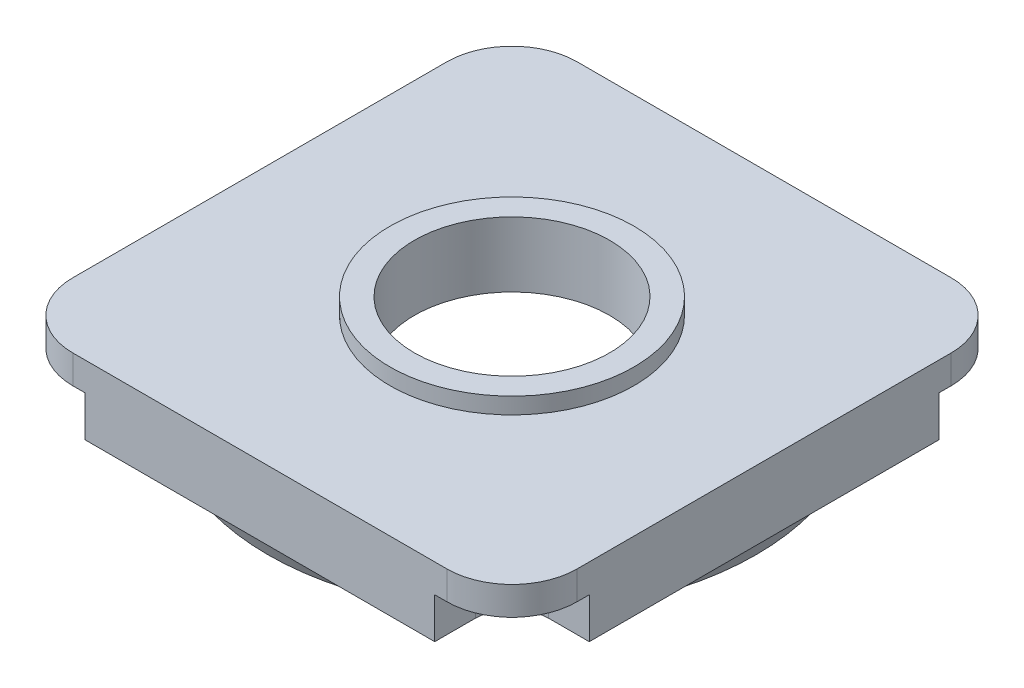
ISO-10303-21;
HEADER;
FILE_DESCRIPTION(('STEP AP214'),'2;1');
FILE_NAME('part.step','',(''),(''),'','','');
FILE_SCHEMA(('AUTOMOTIVE_DESIGN { 1 0 10303 214 1 1 1 1 }'));
ENDSEC;
DATA;
#1=APPLICATION_CONTEXT('core data for automotive mechanical design processes');
#2=APPLICATION_PROTOCOL_DEFINITION('international standard','automotive_design',2000,#1);
#3=PRODUCT_CONTEXT('',#1,'mechanical');
#4=PRODUCT('Part','Part','',(#3));
#5=PRODUCT_RELATED_PRODUCT_CATEGORY('part','',(#4));
#6=PRODUCT_DEFINITION_FORMATION('','',#4);
#7=PRODUCT_DEFINITION_CONTEXT('part definition',#1,'design');
#8=PRODUCT_DEFINITION('design','',#6,#7);
#9=PRODUCT_DEFINITION_SHAPE('','',#8);
#10=(LENGTH_UNIT() NAMED_UNIT(*) SI_UNIT(.MILLI.,.METRE.));
#11=(NAMED_UNIT(*) PLANE_ANGLE_UNIT() SI_UNIT($,.RADIAN.));
#12=(NAMED_UNIT(*) SI_UNIT($,.STERADIAN.) SOLID_ANGLE_UNIT());
#13=UNCERTAINTY_MEASURE_WITH_UNIT(LENGTH_MEASURE(1.E-05),#10,'distance_accuracy_value','');
#14=(GEOMETRIC_REPRESENTATION_CONTEXT(3) GLOBAL_UNCERTAINTY_ASSIGNED_CONTEXT((#13)) GLOBAL_UNIT_ASSIGNED_CONTEXT((#10,
#11,#12)) REPRESENTATION_CONTEXT('',''));
#15=CARTESIAN_POINT('',(0.,0.,0.));
#16=DIRECTION('',(0.,0.,1.));
#17=DIRECTION('',(1.,0.,0.));
#18=AXIS2_PLACEMENT_3D('',#15,#16,#17);
#19=CARTESIAN_POINT('',(0.,12.62465,0.));
#20=DIRECTION('',(0.,-1.,0.));
#21=DIRECTION('',(0.,0.,-1.));
#22=AXIS2_PLACEMENT_3D('',#19,#20,#21);
#23=CYLINDRICAL_SURFACE('',#22,27.);
#24=CARTESIAN_POINT('',(0.,-6.,0.));
#25=DIRECTION('',(0.,-1.,0.));
#26=DIRECTION('',(0.,0.,-1.));
#27=AXIS2_PLACEMENT_3D('',#24,#25,#26);
#28=CIRCLE('',#27,27.);
#29=CARTESIAN_POINT('',(0.,-6.,-27.));
#30=VERTEX_POINT('',#29);
#31=EDGE_CURVE('E192',#30,#30,#28,.F.);
#32=ORIENTED_EDGE('',*,*,#31,.T.);
#33=EDGE_LOOP('',(#32));
#34=FACE_BOUND('',#33,.T.);
#35=CARTESIAN_POINT('',(0.,-11.,0.));
#36=DIRECTION('',(0.,-1.,0.));
#37=DIRECTION('',(0.,0.,-1.));
#38=AXIS2_PLACEMENT_3D('',#35,#36,#37);
#39=CIRCLE('',#38,27.);
#40=CARTESIAN_POINT('',(0.,-11.,-27.));
#41=VERTEX_POINT('',#40);
#42=EDGE_CURVE('E906',#41,#41,#39,.T.);
#43=ORIENTED_EDGE('',*,*,#42,.T.);
#44=EDGE_LOOP('',(#43));
#45=FACE_BOUND('',#44,.T.);
#46=ADVANCED_FACE('F16',(#34,#45),#23,.F.);
#47=CARTESIAN_POINT('',(0.,-10.5,0.));
#48=DIRECTION('',(0.,-1.,0.));
#49=DIRECTION('',(0.,0.,-1.));
#50=AXIS2_PLACEMENT_3D('',#47,#48,#49);
#51=PLANE('',#50);
#52=CARTESIAN_POINT('',(0.,-10.5,0.));
#53=DIRECTION('',(0.,-1.,0.));
#54=DIRECTION('',(0.,0.,-1.));
#55=AXIS2_PLACEMENT_3D('',#52,#53,#54);
#56=CIRCLE('',#55,28.3645835281067);
#57=CARTESIAN_POINT('',(0.,-10.5,-28.3645835281067));
#58=VERTEX_POINT('',#57);
#59=EDGE_CURVE('E11',#58,#58,#56,.T.);
#60=ORIENTED_EDGE('',*,*,#59,.F.);
#61=EDGE_LOOP('',(#60));
#62=FACE_BOUND('',#61,.T.);
#63=CARTESIAN_POINT('',(0.,-10.5,0.));
#64=DIRECTION('',(0.,1.,0.));
#65=DIRECTION('',(0.,0.,1.));
#66=AXIS2_PLACEMENT_3D('',#63,#64,#65);
#67=CIRCLE('',#66,30.);
#68=CARTESIAN_POINT('',(0.,-10.5,30.));
#69=VERTEX_POINT('',#68);
#70=EDGE_CURVE('E173',#69,#69,#67,.T.);
#71=ORIENTED_EDGE('',*,*,#70,.F.);
#72=EDGE_LOOP('',(#71));
#73=FACE_BOUND('',#72,.T.);
#74=ADVANCED_FACE('F528',(#62,#73),#51,.T.);
#75=CARTESIAN_POINT('',(0.,-8.5,0.));
#76=DIRECTION('',(0.,1.,0.));
#77=DIRECTION('',(0.,0.,1.));
#78=AXIS2_PLACEMENT_3D('',#75,#76,#77);
#79=CONICAL_SURFACE('',#78,31.,0.463647609000754);
#80=ORIENTED_EDGE('',*,*,#70,.T.);
#81=EDGE_LOOP('',(#80));
#82=FACE_BOUND('',#81,.T.);
#83=CARTESIAN_POINT('',(0.,-8.5,0.));
#84=DIRECTION('',(0.,1.,0.));
#85=DIRECTION('',(0.,0.,1.));
#86=AXIS2_PLACEMENT_3D('',#83,#84,#85);
#87=CIRCLE('',#86,31.);
#88=CARTESIAN_POINT('',(6.43051965842911E-08,-8.5,31.));
#89=VERTEX_POINT('',#88);
#90=CARTESIAN_POINT('',(-31.,-8.5,5.64992497231742E-10));
#91=VERTEX_POINT('',#90);
#92=EDGE_CURVE('E260',#89,#91,#87,.F.);
#93=ORIENTED_EDGE('',*,*,#92,.T.);
#94=CARTESIAN_POINT('',(0.,-8.5,0.));
#95=DIRECTION('',(0.,1.,0.));
#96=DIRECTION('',(0.,0.,1.));
#97=AXIS2_PLACEMENT_3D('',#94,#95,#96);
#98=CIRCLE('',#97,31.);
#99=CARTESIAN_POINT('',(-6.43051948495677E-08,-8.5,-31.));
#100=VERTEX_POINT('',#99);
#101=EDGE_CURVE('E268',#91,#100,#98,.F.);
#102=ORIENTED_EDGE('',*,*,#101,.T.);
#103=CARTESIAN_POINT('',(0.,-8.5,0.));
#104=DIRECTION('',(0.,1.,0.));
#105=DIRECTION('',(0.,0.,1.));
#106=AXIS2_PLACEMENT_3D('',#103,#104,#105);
#107=CIRCLE('',#106,31.);
#108=CARTESIAN_POINT('',(31.,-8.5,1.02969922519125E-07));
#109=VERTEX_POINT('',#108);
#110=EDGE_CURVE('E178',#100,#109,#107,.F.);
#111=ORIENTED_EDGE('',*,*,#110,.T.);
#112=CARTESIAN_POINT('',(0.,-8.5,0.));
#113=DIRECTION('',(0.,1.,0.));
#114=DIRECTION('',(0.,0.,1.));
#115=AXIS2_PLACEMENT_3D('',#112,#113,#114);
#116=CIRCLE('',#115,31.);
#117=EDGE_CURVE('E276',#109,#89,#116,.F.);
#118=ORIENTED_EDGE('',*,*,#117,.T.);
#119=EDGE_LOOP('',(#93,#102,#111,#118));
#120=FACE_BOUND('',#119,.T.);
#121=ADVANCED_FACE('F358',(#82,#120),#79,.T.);
#122=CARTESIAN_POINT('',(26.,3.8325,-26.));
#123=DIRECTION('',(0.,-1.,0.));
#124=DIRECTION('',(0.,0.,-1.));
#125=AXIS2_PLACEMENT_3D('',#122,#123,#124);
#126=CYLINDRICAL_SURFACE('',#125,4.5);
#127=DIRECTION('',(0.,1.,0.));
#128=VECTOR('',#127,1.);
#129=CARTESIAN_POINT('',(21.5,-3.5,-26.));
#130=LINE('',#129,#128);
#131=CARTESIAN_POINT('',(21.5,-8.5,-26.));
#132=VERTEX_POINT('',#131);
#133=CARTESIAN_POINT('',(21.5,-3.5,-26.));
#134=VERTEX_POINT('',#133);
#135=EDGE_CURVE('E162',#132,#134,#130,.T.);
#136=ORIENTED_EDGE('',*,*,#135,.T.);
#137=CARTESIAN_POINT('',(26.,-3.5,-26.));
#138=DIRECTION('',(0.,-1.,0.));
#139=DIRECTION('',(0.,0.,-1.));
#140=AXIS2_PLACEMENT_3D('',#137,#138,#139);
#141=CIRCLE('',#140,4.5);
#142=CARTESIAN_POINT('',(26.,-3.5,-21.5));
#143=VERTEX_POINT('',#142);
#144=EDGE_CURVE('E257',#143,#134,#141,.T.);
#145=ORIENTED_EDGE('',*,*,#144,.F.);
#146=DIRECTION('',(0.,1.,0.));
#147=VECTOR('',#146,1.);
#148=CARTESIAN_POINT('',(26.,-3.5,-21.5));
#149=LINE('',#148,#147);
#150=CARTESIAN_POINT('',(26.,-8.5,-21.5));
#151=VERTEX_POINT('',#150);
#152=EDGE_CURVE('E182',#143,#151,#149,.F.);
#153=ORIENTED_EDGE('',*,*,#152,.T.);
#154=CARTESIAN_POINT('',(26.,-8.5,-26.));
#155=DIRECTION('',(0.,-1.,0.));
#156=DIRECTION('',(0.,0.,-1.));
#157=AXIS2_PLACEMENT_3D('',#154,#155,#156);
#158=CIRCLE('',#157,4.5);
#159=EDGE_CURVE('E156',#151,#132,#158,.T.);
#160=ORIENTED_EDGE('',*,*,#159,.T.);
#161=EDGE_LOOP('',(#136,#145,#153,#160));
#162=FACE_BOUND('',#161,.T.);
#163=ADVANCED_FACE('F181',(#162),#126,.F.);
#164=CARTESIAN_POINT('',(26.,3.8375,26.));
#165=DIRECTION('',(0.,-1.,0.));
#166=DIRECTION('',(0.,0.,-1.));
#167=AXIS2_PLACEMENT_3D('',#164,#165,#166);
#168=CYLINDRICAL_SURFACE('',#167,4.5);
#169=DIRECTION('',(0.,1.,0.));
#170=VECTOR('',#169,1.);
#171=CARTESIAN_POINT('',(26.,-3.5,21.5));
#172=LINE('',#171,#170);
#173=CARTESIAN_POINT('',(26.,-8.5,21.5));
#174=VERTEX_POINT('',#173);
#175=CARTESIAN_POINT('',(26.,-3.5,21.5));
#176=VERTEX_POINT('',#175);
#177=EDGE_CURVE('E183',#174,#176,#172,.T.);
#178=ORIENTED_EDGE('',*,*,#177,.T.);
#179=CARTESIAN_POINT('',(26.,-3.5,26.));
#180=DIRECTION('',(0.,-1.,0.));
#181=DIRECTION('',(0.,0.,-1.));
#182=AXIS2_PLACEMENT_3D('',#179,#180,#181);
#183=CIRCLE('',#182,4.5);
#184=CARTESIAN_POINT('',(21.5,-3.5,26.));
#185=VERTEX_POINT('',#184);
#186=EDGE_CURVE('E253',#185,#176,#183,.T.);
#187=ORIENTED_EDGE('',*,*,#186,.F.);
#188=DIRECTION('',(0.,1.,0.));
#189=VECTOR('',#188,1.);
#190=CARTESIAN_POINT('',(21.5,-3.5,26.));
#191=LINE('',#190,#189);
#192=CARTESIAN_POINT('',(21.5,-8.5,26.));
#193=VERTEX_POINT('',#192);
#194=EDGE_CURVE('E302',#185,#193,#191,.F.);
#195=ORIENTED_EDGE('',*,*,#194,.T.);
#196=CARTESIAN_POINT('',(26.,-8.5,26.));
#197=DIRECTION('',(0.,-1.,0.));
#198=DIRECTION('',(0.,0.,-1.));
#199=AXIS2_PLACEMENT_3D('',#196,#197,#198);
#200=CIRCLE('',#199,4.5);
#201=EDGE_CURVE('E280',#193,#174,#200,.T.);
#202=ORIENTED_EDGE('',*,*,#201,.T.);
#203=EDGE_LOOP('',(#178,#187,#195,#202));
#204=FACE_BOUND('',#203,.T.);
#205=ADVANCED_FACE('F719',(#204),#168,.F.);
#206=CARTESIAN_POINT('',(-26.,3.8375,-26.));
#207=DIRECTION('',(0.,-1.,0.));
#208=DIRECTION('',(0.,0.,-1.));
#209=AXIS2_PLACEMENT_3D('',#206,#207,#208);
#210=CYLINDRICAL_SURFACE('',#209,4.5);
#211=DIRECTION('',(0.,1.,0.));
#212=VECTOR('',#211,1.);
#213=CARTESIAN_POINT('',(-26.,-3.5,-21.5));
#214=LINE('',#213,#212);
#215=CARTESIAN_POINT('',(-26.,-8.5,-21.5));
#216=VERTEX_POINT('',#215);
#217=CARTESIAN_POINT('',(-26.,-3.5,-21.5));
#218=VERTEX_POINT('',#217);
#219=EDGE_CURVE('E299',#216,#218,#214,.T.);
#220=ORIENTED_EDGE('',*,*,#219,.T.);
#221=CARTESIAN_POINT('',(-26.,-3.5,-26.));
#222=DIRECTION('',(0.,-1.,0.));
#223=DIRECTION('',(0.,0.,-1.));
#224=AXIS2_PLACEMENT_3D('',#221,#222,#223);
#225=CIRCLE('',#224,4.5);
#226=CARTESIAN_POINT('',(-21.5,-3.5,-26.));
#227=VERTEX_POINT('',#226);
#228=EDGE_CURVE('E249',#227,#218,#225,.T.);
#229=ORIENTED_EDGE('',*,*,#228,.F.);
#230=DIRECTION('',(0.,1.,0.));
#231=VECTOR('',#230,1.);
#232=CARTESIAN_POINT('',(-21.5,-3.5,-26.));
#233=LINE('',#232,#231);
#234=CARTESIAN_POINT('',(-21.5,-8.5,-26.));
#235=VERTEX_POINT('',#234);
#236=EDGE_CURVE('E172',#227,#235,#233,.F.);
#237=ORIENTED_EDGE('',*,*,#236,.T.);
#238=CARTESIAN_POINT('',(-26.,-8.5,-26.));
#239=DIRECTION('',(0.,-1.,0.));
#240=DIRECTION('',(0.,0.,-1.));
#241=AXIS2_PLACEMENT_3D('',#238,#239,#240);
#242=CIRCLE('',#241,4.5);
#243=EDGE_CURVE('E272',#235,#216,#242,.T.);
#244=ORIENTED_EDGE('',*,*,#243,.T.);
#245=EDGE_LOOP('',(#220,#229,#237,#244));
#246=FACE_BOUND('',#245,.T.);
#247=ADVANCED_FACE('F726',(#246),#210,.F.);
#248=CARTESIAN_POINT('',(-26.,3.8375,26.));
#249=DIRECTION('',(0.,-1.,0.));
#250=DIRECTION('',(0.,0.,-1.));
#251=AXIS2_PLACEMENT_3D('',#248,#249,#250);
#252=CYLINDRICAL_SURFACE('',#251,4.5);
#253=DIRECTION('',(0.,1.,0.));
#254=VECTOR('',#253,1.);
#255=CARTESIAN_POINT('',(-21.5,-3.5,26.));
#256=LINE('',#255,#254);
#257=CARTESIAN_POINT('',(-21.5,-8.5,26.));
#258=VERTEX_POINT('',#257);
#259=CARTESIAN_POINT('',(-21.5,-3.5,26.));
#260=VERTEX_POINT('',#259);
#261=EDGE_CURVE('E282',#258,#260,#256,.T.);
#262=ORIENTED_EDGE('',*,*,#261,.T.);
#263=CARTESIAN_POINT('',(-26.,-3.5,26.));
#264=DIRECTION('',(0.,-1.,0.));
#265=DIRECTION('',(0.,0.,-1.));
#266=AXIS2_PLACEMENT_3D('',#263,#264,#265);
#267=CIRCLE('',#266,4.5);
#268=CARTESIAN_POINT('',(-26.,-3.5,21.5));
#269=VERTEX_POINT('',#268);
#270=EDGE_CURVE('E246',#269,#260,#267,.T.);
#271=ORIENTED_EDGE('',*,*,#270,.F.);
#272=DIRECTION('',(0.,1.,0.));
#273=VECTOR('',#272,1.);
#274=CARTESIAN_POINT('',(-26.,-3.5,21.5));
#275=LINE('',#274,#273);
#276=CARTESIAN_POINT('',(-26.,-8.5,21.5));
#277=VERTEX_POINT('',#276);
#278=EDGE_CURVE('E296',#269,#277,#275,.F.);
#279=ORIENTED_EDGE('',*,*,#278,.T.);
#280=CARTESIAN_POINT('',(-26.,-8.5,26.));
#281=DIRECTION('',(0.,-1.,0.));
#282=DIRECTION('',(0.,0.,-1.));
#283=AXIS2_PLACEMENT_3D('',#280,#281,#282);
#284=CIRCLE('',#283,4.5);
#285=EDGE_CURVE('E265',#277,#258,#284,.T.);
#286=ORIENTED_EDGE('',*,*,#285,.T.);
#287=EDGE_LOOP('',(#262,#271,#279,#286));
#288=FACE_BOUND('',#287,.T.);
#289=ADVANCED_FACE('F733',(#288),#252,.F.);
#290=CARTESIAN_POINT('',(21.5,-3.5,-26.));
#291=DIRECTION('',(-1.,0.,0.));
#292=DIRECTION('',(0.,0.,1.));
#293=AXIS2_PLACEMENT_3D('',#290,#291,#292);
#294=PLANE('',#293);
#295=DIRECTION('',(0.,0.,-1.));
#296=VECTOR('',#295,1.);
#297=CARTESIAN_POINT('',(21.5,-3.5,-26.));
#298=LINE('',#297,#296);
#299=CARTESIAN_POINT('',(21.5,-3.5,-31.));
#300=VERTEX_POINT('',#299);
#301=EDGE_CURVE('E168',#134,#300,#298,.T.);
#302=ORIENTED_EDGE('',*,*,#301,.F.);
#303=ORIENTED_EDGE('',*,*,#135,.F.);
#304=DIRECTION('',(0.,0.,1.));
#305=VECTOR('',#304,1.);
#306=CARTESIAN_POINT('',(21.5,-8.5,0.));
#307=LINE('',#306,#305);
#308=CARTESIAN_POINT('',(21.5,-8.5,-31.));
#309=VERTEX_POINT('',#308);
#310=EDGE_CURVE('E165',#132,#309,#307,.F.);
#311=ORIENTED_EDGE('',*,*,#310,.T.);
#312=DIRECTION('',(0.,1.,0.));
#313=VECTOR('',#312,1.);
#314=CARTESIAN_POINT('',(21.5,0.,-31.));
#315=LINE('',#314,#313);
#316=EDGE_CURVE('E244',#300,#309,#315,.F.);
#317=ORIENTED_EDGE('',*,*,#316,.F.);
#318=EDGE_LOOP('',(#302,#303,#311,#317));
#319=FACE_BOUND('',#318,.T.);
#320=ADVANCED_FACE('F163',(#319),#294,.F.);
#321=CARTESIAN_POINT('',(-21.5,-3.5,-38.66073282095));
#322=DIRECTION('',(1.,0.,0.));
#323=DIRECTION('',(0.,0.,-1.));
#324=AXIS2_PLACEMENT_3D('',#321,#322,#323);
#325=PLANE('',#324);
#326=DIRECTION('',(0.,0.,-1.));
#327=VECTOR('',#326,1.);
#328=CARTESIAN_POINT('',(-21.5,-3.5,-26.));
#329=LINE('',#328,#327);
#330=CARTESIAN_POINT('',(-21.5,-3.5,-31.));
#331=VERTEX_POINT('',#330);
#332=EDGE_CURVE('E252',#331,#227,#329,.F.);
#333=ORIENTED_EDGE('',*,*,#332,.F.);
#334=DIRECTION('',(0.,1.,0.));
#335=VECTOR('',#334,1.);
#336=CARTESIAN_POINT('',(-21.5,0.,-31.));
#337=LINE('',#336,#335);
#338=CARTESIAN_POINT('',(-21.5,-8.5,-31.));
#339=VERTEX_POINT('',#338);
#340=EDGE_CURVE('E347',#339,#331,#337,.T.);
#341=ORIENTED_EDGE('',*,*,#340,.F.);
#342=DIRECTION('',(0.,0.,1.));
#343=VECTOR('',#342,1.);
#344=CARTESIAN_POINT('',(-21.5,-8.5,0.));
#345=LINE('',#344,#343);
#346=EDGE_CURVE('E275',#339,#235,#345,.T.);
#347=ORIENTED_EDGE('',*,*,#346,.T.);
#348=ORIENTED_EDGE('',*,*,#236,.F.);
#349=EDGE_LOOP('',(#333,#341,#347,#348));
#350=FACE_BOUND('',#349,.T.);
#351=ADVANCED_FACE('F747',(#350),#325,.F.);
#352=CARTESIAN_POINT('',(26.,-3.5,21.5));
#353=DIRECTION('',(0.,0.,-1.));
#354=DIRECTION('',(-1.,0.,0.));
#355=AXIS2_PLACEMENT_3D('',#352,#353,#354);
#356=PLANE('',#355);
#357=DIRECTION('',(1.,0.,0.));
#358=VECTOR('',#357,1.);
#359=CARTESIAN_POINT('',(26.,-3.5,21.5));
#360=LINE('',#359,#358);
#361=CARTESIAN_POINT('',(31.,-3.5,21.5));
#362=VERTEX_POINT('',#361);
#363=EDGE_CURVE('E255',#176,#362,#360,.T.);
#364=ORIENTED_EDGE('',*,*,#363,.F.);
#365=ORIENTED_EDGE('',*,*,#177,.F.);
#366=DIRECTION('',(1.,0.,0.));
#367=VECTOR('',#366,1.);
#368=CARTESIAN_POINT('',(0.,-8.5,21.5));
#369=LINE('',#368,#367);
#370=CARTESIAN_POINT('',(31.,-8.5,21.5));
#371=VERTEX_POINT('',#370);
#372=EDGE_CURVE('E279',#174,#371,#369,.T.);
#373=ORIENTED_EDGE('',*,*,#372,.T.);
#374=DIRECTION('',(0.,1.,0.));
#375=VECTOR('',#374,1.);
#376=CARTESIAN_POINT('',(31.,0.,21.5));
#377=LINE('',#376,#375);
#378=EDGE_CURVE('E240',#362,#371,#377,.F.);
#379=ORIENTED_EDGE('',*,*,#378,.F.);
#380=EDGE_LOOP('',(#364,#365,#373,#379));
#381=FACE_BOUND('',#380,.T.);
#382=ADVANCED_FACE('F477',(#381),#356,.F.);
#383=CARTESIAN_POINT('',(0.,-8.5,0.));
#384=DIRECTION('',(0.,1.,0.));
#385=DIRECTION('',(0.,0.,1.));
#386=AXIS2_PLACEMENT_3D('',#383,#384,#385);
#387=PLANE('',#386);
#388=ORIENTED_EDGE('',*,*,#110,.F.);
#389=DIRECTION('',(-1.,0.,0.));
#390=VECTOR('',#389,1.);
#391=CARTESIAN_POINT('',(31.,-8.5,-31.));
#392=LINE('',#391,#390);
#393=EDGE_CURVE('E177',#309,#100,#392,.T.);
#394=ORIENTED_EDGE('',*,*,#393,.F.);
#395=ORIENTED_EDGE('',*,*,#310,.F.);
#396=ORIENTED_EDGE('',*,*,#159,.F.);
#397=DIRECTION('',(1.,0.,0.));
#398=VECTOR('',#397,1.);
#399=CARTESIAN_POINT('',(36.69825239515,-8.5,-21.5));
#400=LINE('',#399,#398);
#401=CARTESIAN_POINT('',(31.,-8.5,-21.5));
#402=VERTEX_POINT('',#401);
#403=EDGE_CURVE('E292',#151,#402,#400,.T.);
#404=ORIENTED_EDGE('',*,*,#403,.T.);
#405=DIRECTION('',(0.,0.,-1.));
#406=VECTOR('',#405,1.);
#407=CARTESIAN_POINT('',(31.,-8.5,31.));
#408=LINE('',#407,#406);
#409=EDGE_CURVE('E333',#109,#402,#408,.T.);
#410=ORIENTED_EDGE('',*,*,#409,.F.);
#411=EDGE_LOOP('',(#388,#394,#395,#396,#404,#410));
#412=FACE_BOUND('',#411,.T.);
#413=ADVANCED_FACE('F175',(#412),#387,.F.);
#414=CARTESIAN_POINT('',(36.69825239515,-3.5,-21.5));
#415=DIRECTION('',(0.,0.,1.));
#416=DIRECTION('',(1.,0.,0.));
#417=AXIS2_PLACEMENT_3D('',#414,#415,#416);
#418=PLANE('',#417);
#419=DIRECTION('',(1.,0.,0.));
#420=VECTOR('',#419,1.);
#421=CARTESIAN_POINT('',(26.,-3.5,-21.5));
#422=LINE('',#421,#420);
#423=CARTESIAN_POINT('',(31.,-3.5,-21.5));
#424=VERTEX_POINT('',#423);
#425=EDGE_CURVE('E259',#424,#143,#422,.F.);
#426=ORIENTED_EDGE('',*,*,#425,.F.);
#427=DIRECTION('',(0.,1.,0.));
#428=VECTOR('',#427,1.);
#429=CARTESIAN_POINT('',(31.,0.,-21.5));
#430=LINE('',#429,#428);
#431=EDGE_CURVE('E330',#402,#424,#430,.T.);
#432=ORIENTED_EDGE('',*,*,#431,.F.);
#433=ORIENTED_EDGE('',*,*,#403,.F.);
#434=ORIENTED_EDGE('',*,*,#152,.F.);
#435=EDGE_LOOP('',(#426,#432,#433,#434));
#436=FACE_BOUND('',#435,.T.);
#437=ADVANCED_FACE('F484',(#436),#418,.F.);
#438=CARTESIAN_POINT('',(-21.5,-3.5,26.));
#439=DIRECTION('',(1.,0.,0.));
#440=DIRECTION('',(0.,0.,-1.));
#441=AXIS2_PLACEMENT_3D('',#438,#439,#440);
#442=PLANE('',#441);
#443=DIRECTION('',(0.,0.,-1.));
#444=VECTOR('',#443,1.);
#445=CARTESIAN_POINT('',(-21.5,-3.5,-26.));
#446=LINE('',#445,#444);
#447=CARTESIAN_POINT('',(-21.5,-3.5,31.));
#448=VERTEX_POINT('',#447);
#449=EDGE_CURVE('E245',#260,#448,#446,.F.);
#450=ORIENTED_EDGE('',*,*,#449,.F.);
#451=ORIENTED_EDGE('',*,*,#261,.F.);
#452=DIRECTION('',(0.,0.,1.));
#453=VECTOR('',#452,1.);
#454=CARTESIAN_POINT('',(-21.5,-8.5,0.));
#455=LINE('',#454,#453);
#456=CARTESIAN_POINT('',(-21.5,-8.5,31.));
#457=VERTEX_POINT('',#456);
#458=EDGE_CURVE('E264',#258,#457,#455,.T.);
#459=ORIENTED_EDGE('',*,*,#458,.T.);
#460=DIRECTION('',(0.,1.,0.));
#461=VECTOR('',#460,1.);
#462=CARTESIAN_POINT('',(-21.5,0.,31.));
#463=LINE('',#462,#461);
#464=EDGE_CURVE('E235',#448,#457,#463,.F.);
#465=ORIENTED_EDGE('',*,*,#464,.F.);
#466=EDGE_LOOP('',(#450,#451,#459,#465));
#467=FACE_BOUND('',#466,.T.);
#468=ADVANCED_FACE('F505',(#467),#442,.F.);
#469=CARTESIAN_POINT('',(0.,-8.5,0.));
#470=DIRECTION('',(0.,1.,0.));
#471=DIRECTION('',(0.,0.,1.));
#472=AXIS2_PLACEMENT_3D('',#469,#470,#471);
#473=PLANE('',#472);
#474=ORIENTED_EDGE('',*,*,#117,.F.);
#475=DIRECTION('',(0.,0.,-1.));
#476=VECTOR('',#475,1.);
#477=CARTESIAN_POINT('',(31.,-8.5,31.));
#478=LINE('',#477,#476);
#479=EDGE_CURVE('E327',#371,#109,#478,.T.);
#480=ORIENTED_EDGE('',*,*,#479,.F.);
#481=ORIENTED_EDGE('',*,*,#372,.F.);
#482=ORIENTED_EDGE('',*,*,#201,.F.);
#483=DIRECTION('',(0.,0.,1.));
#484=VECTOR('',#483,1.);
#485=CARTESIAN_POINT('',(21.5,-8.5,38.66073282095));
#486=LINE('',#485,#484);
#487=CARTESIAN_POINT('',(21.5,-8.5,31.));
#488=VERTEX_POINT('',#487);
#489=EDGE_CURVE('E278',#193,#488,#486,.T.);
#490=ORIENTED_EDGE('',*,*,#489,.T.);
#491=DIRECTION('',(1.,0.,0.));
#492=VECTOR('',#491,1.);
#493=CARTESIAN_POINT('',(-31.,-8.5,31.));
#494=LINE('',#493,#492);
#495=EDGE_CURVE('E315',#89,#488,#494,.T.);
#496=ORIENTED_EDGE('',*,*,#495,.F.);
#497=EDGE_LOOP('',(#474,#480,#481,#482,#490,#496));
#498=FACE_BOUND('',#497,.T.);
#499=ADVANCED_FACE('F480',(#498),#473,.F.);
#500=CARTESIAN_POINT('',(21.5,-3.5,38.66073282095));
#501=DIRECTION('',(-1.,0.,0.));
#502=DIRECTION('',(0.,0.,1.));
#503=AXIS2_PLACEMENT_3D('',#500,#501,#502);
#504=PLANE('',#503);
#505=DIRECTION('',(0.,0.,-1.));
#506=VECTOR('',#505,1.);
#507=CARTESIAN_POINT('',(21.5,-3.5,-26.));
#508=LINE('',#507,#506);
#509=CARTESIAN_POINT('',(21.5,-3.5,31.));
#510=VERTEX_POINT('',#509);
#511=EDGE_CURVE('E256',#510,#185,#508,.T.);
#512=ORIENTED_EDGE('',*,*,#511,.F.);
#513=DIRECTION('',(0.,1.,0.));
#514=VECTOR('',#513,1.);
#515=CARTESIAN_POINT('',(21.5,0.,31.));
#516=LINE('',#515,#514);
#517=EDGE_CURVE('E313',#488,#510,#516,.T.);
#518=ORIENTED_EDGE('',*,*,#517,.F.);
#519=ORIENTED_EDGE('',*,*,#489,.F.);
#520=ORIENTED_EDGE('',*,*,#194,.F.);
#521=EDGE_LOOP('',(#512,#518,#519,#520));
#522=FACE_BOUND('',#521,.T.);
#523=ADVANCED_FACE('F392',(#522),#504,.F.);
#524=CARTESIAN_POINT('',(-26.,-3.5,-21.5));
#525=DIRECTION('',(0.,0.,1.));
#526=DIRECTION('',(1.,0.,0.));
#527=AXIS2_PLACEMENT_3D('',#524,#525,#526);
#528=PLANE('',#527);
#529=DIRECTION('',(1.,0.,0.));
#530=VECTOR('',#529,1.);
#531=CARTESIAN_POINT('',(26.,-3.5,-21.5));
#532=LINE('',#531,#530);
#533=CARTESIAN_POINT('',(-31.,-3.5,-21.5));
#534=VERTEX_POINT('',#533);
#535=EDGE_CURVE('E251',#218,#534,#532,.F.);
#536=ORIENTED_EDGE('',*,*,#535,.F.);
#537=ORIENTED_EDGE('',*,*,#219,.F.);
#538=DIRECTION('',(1.,0.,0.));
#539=VECTOR('',#538,1.);
#540=CARTESIAN_POINT('',(0.,-8.5,-21.5));
#541=LINE('',#540,#539);
#542=CARTESIAN_POINT('',(-31.,-8.5,-21.5));
#543=VERTEX_POINT('',#542);
#544=EDGE_CURVE('E271',#216,#543,#541,.F.);
#545=ORIENTED_EDGE('',*,*,#544,.T.);
#546=DIRECTION('',(0.,1.,0.));
#547=VECTOR('',#546,1.);
#548=CARTESIAN_POINT('',(-31.,0.,-21.5));
#549=LINE('',#548,#547);
#550=EDGE_CURVE('E230',#534,#543,#549,.F.);
#551=ORIENTED_EDGE('',*,*,#550,.F.);
#552=EDGE_LOOP('',(#536,#537,#545,#551));
#553=FACE_BOUND('',#552,.T.);
#554=ADVANCED_FACE('F790',(#553),#528,.F.);
#555=CARTESIAN_POINT('',(0.,-8.5,0.));
#556=DIRECTION('',(0.,1.,0.));
#557=DIRECTION('',(0.,0.,1.));
#558=AXIS2_PLACEMENT_3D('',#555,#556,#557);
#559=PLANE('',#558);
#560=ORIENTED_EDGE('',*,*,#101,.F.);
#561=DIRECTION('',(0.,0.,1.));
#562=VECTOR('',#561,1.);
#563=CARTESIAN_POINT('',(-31.,-8.5,-31.));
#564=LINE('',#563,#562);
#565=EDGE_CURVE('E442',#543,#91,#564,.T.);
#566=ORIENTED_EDGE('',*,*,#565,.F.);
#567=ORIENTED_EDGE('',*,*,#544,.F.);
#568=ORIENTED_EDGE('',*,*,#243,.F.);
#569=ORIENTED_EDGE('',*,*,#346,.F.);
#570=DIRECTION('',(-1.,0.,0.));
#571=VECTOR('',#570,1.);
#572=CARTESIAN_POINT('',(31.,-8.5,-31.));
#573=LINE('',#572,#571);
#574=EDGE_CURVE('E349',#100,#339,#573,.T.);
#575=ORIENTED_EDGE('',*,*,#574,.F.);
#576=EDGE_LOOP('',(#560,#566,#567,#568,#569,#575));
#577=FACE_BOUND('',#576,.T.);
#578=ADVANCED_FACE('F365',(#577),#559,.F.);
#579=CARTESIAN_POINT('',(0.,-8.5,0.));
#580=DIRECTION('',(0.,1.,0.));
#581=DIRECTION('',(0.,0.,1.));
#582=AXIS2_PLACEMENT_3D('',#579,#580,#581);
#583=PLANE('',#582);
#584=ORIENTED_EDGE('',*,*,#92,.F.);
#585=DIRECTION('',(1.,0.,0.));
#586=VECTOR('',#585,1.);
#587=CARTESIAN_POINT('',(-31.,-8.5,31.));
#588=LINE('',#587,#586);
#589=EDGE_CURVE('E317',#457,#89,#588,.T.);
#590=ORIENTED_EDGE('',*,*,#589,.F.);
#591=ORIENTED_EDGE('',*,*,#458,.F.);
#592=ORIENTED_EDGE('',*,*,#285,.F.);
#593=DIRECTION('',(-1.,0.,0.));
#594=VECTOR('',#593,1.);
#595=CARTESIAN_POINT('',(-36.69825239515,-8.5,21.5));
#596=LINE('',#595,#594);
#597=CARTESIAN_POINT('',(-31.,-8.5,21.5));
#598=VERTEX_POINT('',#597);
#599=EDGE_CURVE('E263',#277,#598,#596,.T.);
#600=ORIENTED_EDGE('',*,*,#599,.T.);
#601=DIRECTION('',(0.,0.,1.));
#602=VECTOR('',#601,1.);
#603=CARTESIAN_POINT('',(-31.,-8.5,-31.));
#604=LINE('',#603,#602);
#605=EDGE_CURVE('E447',#91,#598,#604,.T.);
#606=ORIENTED_EDGE('',*,*,#605,.F.);
#607=EDGE_LOOP('',(#584,#590,#591,#592,#600,#606));
#608=FACE_BOUND('',#607,.T.);
#609=ADVANCED_FACE('F509',(#608),#583,.F.);
#610=CARTESIAN_POINT('',(-36.69825239515,-3.5,21.5));
#611=DIRECTION('',(0.,0.,-1.));
#612=DIRECTION('',(-1.,0.,0.));
#613=AXIS2_PLACEMENT_3D('',#610,#611,#612);
#614=PLANE('',#613);
#615=DIRECTION('',(1.,0.,0.));
#616=VECTOR('',#615,1.);
#617=CARTESIAN_POINT('',(26.,-3.5,21.5));
#618=LINE('',#617,#616);
#619=CARTESIAN_POINT('',(-31.,-3.5,21.5));
#620=VERTEX_POINT('',#619);
#621=EDGE_CURVE('E248',#620,#269,#618,.T.);
#622=ORIENTED_EDGE('',*,*,#621,.F.);
#623=DIRECTION('',(0.,1.,0.));
#624=VECTOR('',#623,1.);
#625=CARTESIAN_POINT('',(-31.,0.,21.5));
#626=LINE('',#625,#624);
#627=EDGE_CURVE('E444',#598,#620,#626,.T.);
#628=ORIENTED_EDGE('',*,*,#627,.F.);
#629=ORIENTED_EDGE('',*,*,#599,.F.);
#630=ORIENTED_EDGE('',*,*,#278,.F.);
#631=EDGE_LOOP('',(#622,#628,#629,#630));
#632=FACE_BOUND('',#631,.T.);
#633=ADVANCED_FACE('F512',(#632),#614,.F.);
#634=CARTESIAN_POINT('',(26.,-3.5,-26.));
#635=DIRECTION('',(0.,-1.,0.));
#636=DIRECTION('',(0.,0.,-1.));
#637=AXIS2_PLACEMENT_3D('',#634,#635,#636);
#638=PLANE('',#637);
#639=ORIENTED_EDGE('',*,*,#425,.T.);
#640=ORIENTED_EDGE('',*,*,#144,.T.);
#641=ORIENTED_EDGE('',*,*,#301,.T.);
#642=DIRECTION('',(-1.,0.,0.));
#643=VECTOR('',#642,1.);
#644=CARTESIAN_POINT('',(31.,-3.5,-31.));
#645=LINE('',#644,#643);
#646=CARTESIAN_POINT('',(23.,-3.5,-31.));
#647=VERTEX_POINT('',#646);
#648=EDGE_CURVE('E339',#647,#300,#645,.T.);
#649=ORIENTED_EDGE('',*,*,#648,.F.);
#650=CARTESIAN_POINT('',(23.,-3.5,-23.));
#651=DIRECTION('',(0.,-1.,0.));
#652=DIRECTION('',(0.,0.,-1.));
#653=AXIS2_PLACEMENT_3D('',#650,#651,#652);
#654=CIRCLE('',#653,8.);
#655=CARTESIAN_POINT('',(31.,-3.5,-23.));
#656=VERTEX_POINT('',#655);
#657=EDGE_CURVE('E237',#656,#647,#654,.F.);
#658=ORIENTED_EDGE('',*,*,#657,.F.);
#659=DIRECTION('',(0.,0.,-1.));
#660=VECTOR('',#659,1.);
#661=CARTESIAN_POINT('',(31.,-3.5,31.));
#662=LINE('',#661,#660);
#663=EDGE_CURVE('E328',#424,#656,#662,.T.);
#664=ORIENTED_EDGE('',*,*,#663,.F.);
#665=EDGE_LOOP('',(#639,#640,#641,#649,#658,#664));
#666=FACE_BOUND('',#665,.T.);
#667=ADVANCED_FACE('F487',(#666),#638,.T.);
#668=CARTESIAN_POINT('',(26.,-3.5,-26.));
#669=DIRECTION('',(0.,-1.,0.));
#670=DIRECTION('',(0.,0.,-1.));
#671=AXIS2_PLACEMENT_3D('',#668,#669,#670);
#672=PLANE('',#671);
#673=ORIENTED_EDGE('',*,*,#186,.T.);
#674=ORIENTED_EDGE('',*,*,#363,.T.);
#675=DIRECTION('',(0.,0.,-1.));
#676=VECTOR('',#675,1.);
#677=CARTESIAN_POINT('',(31.,-3.5,31.));
#678=LINE('',#677,#676);
#679=CARTESIAN_POINT('',(31.,-3.5,23.));
#680=VERTEX_POINT('',#679);
#681=EDGE_CURVE('E321',#680,#362,#678,.T.);
#682=ORIENTED_EDGE('',*,*,#681,.F.);
#683=CARTESIAN_POINT('',(23.,-3.5,23.));
#684=DIRECTION('',(0.,-1.,0.));
#685=DIRECTION('',(0.,0.,-1.));
#686=AXIS2_PLACEMENT_3D('',#683,#684,#685);
#687=CIRCLE('',#686,8.);
#688=CARTESIAN_POINT('',(23.,-3.5,31.));
#689=VERTEX_POINT('',#688);
#690=EDGE_CURVE('E232',#689,#680,#687,.F.);
#691=ORIENTED_EDGE('',*,*,#690,.F.);
#692=DIRECTION('',(1.,0.,0.));
#693=VECTOR('',#692,1.);
#694=CARTESIAN_POINT('',(-31.,-3.5,31.));
#695=LINE('',#694,#693);
#696=EDGE_CURVE('E380',#510,#689,#695,.T.);
#697=ORIENTED_EDGE('',*,*,#696,.F.);
#698=ORIENTED_EDGE('',*,*,#511,.T.);
#699=EDGE_LOOP('',(#673,#674,#682,#691,#697,#698));
#700=FACE_BOUND('',#699,.T.);
#701=ADVANCED_FACE('F395',(#700),#672,.T.);
#702=CARTESIAN_POINT('',(26.,-3.5,-26.));
#703=DIRECTION('',(0.,-1.,0.));
#704=DIRECTION('',(0.,0.,-1.));
#705=AXIS2_PLACEMENT_3D('',#702,#703,#704);
#706=PLANE('',#705);
#707=ORIENTED_EDGE('',*,*,#228,.T.);
#708=ORIENTED_EDGE('',*,*,#535,.T.);
#709=DIRECTION('',(0.,0.,1.));
#710=VECTOR('',#709,1.);
#711=CARTESIAN_POINT('',(-31.,-3.5,-31.));
#712=LINE('',#711,#710);
#713=CARTESIAN_POINT('',(-31.,-3.5,-23.));
#714=VERTEX_POINT('',#713);
#715=EDGE_CURVE('E226',#714,#534,#712,.T.);
#716=ORIENTED_EDGE('',*,*,#715,.F.);
#717=CARTESIAN_POINT('',(-23.,-3.5,-23.));
#718=DIRECTION('',(0.,-1.,0.));
#719=DIRECTION('',(0.,0.,-1.));
#720=AXIS2_PLACEMENT_3D('',#717,#718,#719);
#721=CIRCLE('',#720,8.);
#722=CARTESIAN_POINT('',(-23.,-3.5,-31.));
#723=VERTEX_POINT('',#722);
#724=EDGE_CURVE('E242',#723,#714,#721,.F.);
#725=ORIENTED_EDGE('',*,*,#724,.F.);
#726=DIRECTION('',(-1.,0.,0.));
#727=VECTOR('',#726,1.);
#728=CARTESIAN_POINT('',(31.,-3.5,-31.));
#729=LINE('',#728,#727);
#730=EDGE_CURVE('E345',#331,#723,#729,.T.);
#731=ORIENTED_EDGE('',*,*,#730,.F.);
#732=ORIENTED_EDGE('',*,*,#332,.T.);
#733=EDGE_LOOP('',(#707,#708,#716,#725,#731,#732));
#734=FACE_BOUND('',#733,.T.);
#735=ADVANCED_FACE('F516',(#734),#706,.T.);
#736=CARTESIAN_POINT('',(26.,-3.5,-26.));
#737=DIRECTION('',(0.,-1.,0.));
#738=DIRECTION('',(0.,0.,-1.));
#739=AXIS2_PLACEMENT_3D('',#736,#737,#738);
#740=PLANE('',#739);
#741=ORIENTED_EDGE('',*,*,#270,.T.);
#742=ORIENTED_EDGE('',*,*,#449,.T.);
#743=DIRECTION('',(1.,0.,0.));
#744=VECTOR('',#743,1.);
#745=CARTESIAN_POINT('',(-31.,-3.5,31.));
#746=LINE('',#745,#744);
#747=CARTESIAN_POINT('',(-23.,-3.5,31.));
#748=VERTEX_POINT('',#747);
#749=EDGE_CURVE('E375',#748,#448,#746,.T.);
#750=ORIENTED_EDGE('',*,*,#749,.F.);
#751=CARTESIAN_POINT('',(-23.,-3.5,23.));
#752=DIRECTION('',(0.,-1.,0.));
#753=DIRECTION('',(0.,0.,-1.));
#754=AXIS2_PLACEMENT_3D('',#751,#752,#753);
#755=CIRCLE('',#754,8.);
#756=CARTESIAN_POINT('',(-31.,-3.5,23.));
#757=VERTEX_POINT('',#756);
#758=EDGE_CURVE('E227',#757,#748,#755,.F.);
#759=ORIENTED_EDGE('',*,*,#758,.F.);
#760=DIRECTION('',(0.,0.,1.));
#761=VECTOR('',#760,1.);
#762=CARTESIAN_POINT('',(-31.,-3.5,-31.));
#763=LINE('',#762,#761);
#764=EDGE_CURVE('E418',#620,#757,#763,.T.);
#765=ORIENTED_EDGE('',*,*,#764,.F.);
#766=ORIENTED_EDGE('',*,*,#621,.T.);
#767=EDGE_LOOP('',(#741,#742,#750,#759,#765,#766));
#768=FACE_BOUND('',#767,.T.);
#769=ADVANCED_FACE('F514',(#768),#740,.T.);
#770=CARTESIAN_POINT('',(-23.,18.295,-23.));
#771=DIRECTION('',(0.,-1.,0.));
#772=DIRECTION('',(0.,0.,-1.));
#773=AXIS2_PLACEMENT_3D('',#770,#771,#772);
#774=CYLINDRICAL_SURFACE('',#773,8.);
#775=DIRECTION('',(0.,1.,0.));
#776=VECTOR('',#775,1.);
#777=CARTESIAN_POINT('',(-23.,0.,-31.));
#778=LINE('',#777,#776);
#779=CARTESIAN_POINT('',(-23.,0.,-31.));
#780=VERTEX_POINT('',#779);
#781=EDGE_CURVE('E342',#723,#780,#778,.T.);
#782=ORIENTED_EDGE('',*,*,#781,.F.);
#783=ORIENTED_EDGE('',*,*,#724,.T.);
#784=DIRECTION('',(0.,1.,0.));
#785=VECTOR('',#784,1.);
#786=CARTESIAN_POINT('',(-31.,0.,-23.));
#787=LINE('',#786,#785);
#788=CARTESIAN_POINT('',(-31.,0.,-23.));
#789=VERTEX_POINT('',#788);
#790=EDGE_CURVE('E417',#789,#714,#787,.F.);
#791=ORIENTED_EDGE('',*,*,#790,.F.);
#792=CARTESIAN_POINT('',(-23.,0.,-23.));
#793=DIRECTION('',(0.,-1.,0.));
#794=DIRECTION('',(0.,0.,-1.));
#795=AXIS2_PLACEMENT_3D('',#792,#793,#794);
#796=CIRCLE('',#795,8.);
#797=EDGE_CURVE('E223',#789,#780,#796,.T.);
#798=ORIENTED_EDGE('',*,*,#797,.T.);
#799=EDGE_LOOP('',(#782,#783,#791,#798));
#800=FACE_BOUND('',#799,.T.);
#801=ADVANCED_FACE('F496',(#800),#774,.T.);
#802=CARTESIAN_POINT('',(31.,0.,-31.));
#803=DIRECTION('',(0.,0.,-1.));
#804=DIRECTION('',(-1.,0.,0.));
#805=AXIS2_PLACEMENT_3D('',#802,#803,#804);
#806=PLANE('',#805);
#807=DIRECTION('',(0.,-1.,0.));
#808=VECTOR('',#807,1.);
#809=CARTESIAN_POINT('',(23.,18.295,-31.));
#810=LINE('',#809,#808);
#811=CARTESIAN_POINT('',(23.,0.,-31.));
#812=VERTEX_POINT('',#811);
#813=EDGE_CURVE('E241',#647,#812,#810,.F.);
#814=ORIENTED_EDGE('',*,*,#813,.F.);
#815=ORIENTED_EDGE('',*,*,#648,.T.);
#816=ORIENTED_EDGE('',*,*,#316,.T.);
#817=ORIENTED_EDGE('',*,*,#393,.T.);
#818=ORIENTED_EDGE('',*,*,#574,.T.);
#819=ORIENTED_EDGE('',*,*,#340,.T.);
#820=ORIENTED_EDGE('',*,*,#730,.T.);
#821=ORIENTED_EDGE('',*,*,#781,.T.);
#822=DIRECTION('',(1.,0.,0.));
#823=VECTOR('',#822,1.);
#824=CARTESIAN_POINT('',(0.,0.,-31.));
#825=LINE('',#824,#823);
#826=EDGE_CURVE('E222',#780,#812,#825,.T.);
#827=ORIENTED_EDGE('',*,*,#826,.T.);
#828=EDGE_LOOP('',(#814,#815,#816,#817,#818,#819,#820,#821,#827));
#829=FACE_BOUND('',#828,.T.);
#830=ADVANCED_FACE('F355',(#829),#806,.T.);
#831=CARTESIAN_POINT('',(23.,18.295,-23.));
#832=DIRECTION('',(0.,-1.,0.));
#833=DIRECTION('',(0.,0.,-1.));
#834=AXIS2_PLACEMENT_3D('',#831,#832,#833);
#835=CYLINDRICAL_SURFACE('',#834,8.);
#836=DIRECTION('',(0.,1.,0.));
#837=VECTOR('',#836,1.);
#838=CARTESIAN_POINT('',(31.,0.,-23.));
#839=LINE('',#838,#837);
#840=CARTESIAN_POINT('',(31.,0.,-23.));
#841=VERTEX_POINT('',#840);
#842=EDGE_CURVE('E324',#656,#841,#839,.T.);
#843=ORIENTED_EDGE('',*,*,#842,.F.);
#844=ORIENTED_EDGE('',*,*,#657,.T.);
#845=ORIENTED_EDGE('',*,*,#813,.T.);
#846=CARTESIAN_POINT('',(23.,0.,-23.));
#847=DIRECTION('',(0.,-1.,0.));
#848=DIRECTION('',(0.,0.,-1.));
#849=AXIS2_PLACEMENT_3D('',#846,#847,#848);
#850=CIRCLE('',#849,8.);
#851=EDGE_CURVE('E219',#812,#841,#850,.T.);
#852=ORIENTED_EDGE('',*,*,#851,.T.);
#853=EDGE_LOOP('',(#843,#844,#845,#852));
#854=FACE_BOUND('',#853,.T.);
#855=ADVANCED_FACE('F492',(#854),#835,.T.);
#856=CARTESIAN_POINT('',(31.,0.,31.));
#857=DIRECTION('',(1.,0.,0.));
#858=DIRECTION('',(0.,0.,-1.));
#859=AXIS2_PLACEMENT_3D('',#856,#857,#858);
#860=PLANE('',#859);
#861=DIRECTION('',(0.,-1.,0.));
#862=VECTOR('',#861,1.);
#863=CARTESIAN_POINT('',(31.,18.295,23.));
#864=LINE('',#863,#862);
#865=CARTESIAN_POINT('',(31.,0.,23.));
#866=VERTEX_POINT('',#865);
#867=EDGE_CURVE('E236',#680,#866,#864,.F.);
#868=ORIENTED_EDGE('',*,*,#867,.F.);
#869=ORIENTED_EDGE('',*,*,#681,.T.);
#870=ORIENTED_EDGE('',*,*,#378,.T.);
#871=ORIENTED_EDGE('',*,*,#479,.T.);
#872=ORIENTED_EDGE('',*,*,#409,.T.);
#873=ORIENTED_EDGE('',*,*,#431,.T.);
#874=ORIENTED_EDGE('',*,*,#663,.T.);
#875=ORIENTED_EDGE('',*,*,#842,.T.);
#876=DIRECTION('',(0.,0.,-1.));
#877=VECTOR('',#876,1.);
#878=CARTESIAN_POINT('',(31.,0.,0.));
#879=LINE('',#878,#877);
#880=EDGE_CURVE('E218',#841,#866,#879,.F.);
#881=ORIENTED_EDGE('',*,*,#880,.T.);
#882=EDGE_LOOP('',(#868,#869,#870,#871,#872,#873,#874,#875,#881));
#883=FACE_BOUND('',#882,.T.);
#884=ADVANCED_FACE('F476',(#883),#860,.T.);
#885=CARTESIAN_POINT('',(23.,18.295,23.));
#886=DIRECTION('',(0.,-1.,0.));
#887=DIRECTION('',(0.,0.,-1.));
#888=AXIS2_PLACEMENT_3D('',#885,#886,#887);
#889=CYLINDRICAL_SURFACE('',#888,8.);
#890=DIRECTION('',(0.,1.,0.));
#891=VECTOR('',#890,1.);
#892=CARTESIAN_POINT('',(23.,0.,31.));
#893=LINE('',#892,#891);
#894=CARTESIAN_POINT('',(23.,0.,31.));
#895=VERTEX_POINT('',#894);
#896=EDGE_CURVE('E378',#689,#895,#893,.T.);
#897=ORIENTED_EDGE('',*,*,#896,.F.);
#898=ORIENTED_EDGE('',*,*,#690,.T.);
#899=ORIENTED_EDGE('',*,*,#867,.T.);
#900=CARTESIAN_POINT('',(23.,0.,23.));
#901=DIRECTION('',(0.,-1.,0.));
#902=DIRECTION('',(0.,0.,-1.));
#903=AXIS2_PLACEMENT_3D('',#900,#901,#902);
#904=CIRCLE('',#903,8.);
#905=EDGE_CURVE('E215',#866,#895,#904,.T.);
#906=ORIENTED_EDGE('',*,*,#905,.T.);
#907=EDGE_LOOP('',(#897,#898,#899,#906));
#908=FACE_BOUND('',#907,.T.);
#909=ADVANCED_FACE('F400',(#908),#889,.T.);
#910=CARTESIAN_POINT('',(-31.,0.,31.));
#911=DIRECTION('',(0.,0.,1.));
#912=DIRECTION('',(1.,0.,0.));
#913=AXIS2_PLACEMENT_3D('',#910,#911,#912);
#914=PLANE('',#913);
#915=DIRECTION('',(0.,-1.,0.));
#916=VECTOR('',#915,1.);
#917=CARTESIAN_POINT('',(-23.,18.295,31.));
#918=LINE('',#917,#916);
#919=CARTESIAN_POINT('',(-23.,0.,31.));
#920=VERTEX_POINT('',#919);
#921=EDGE_CURVE('E231',#748,#920,#918,.F.);
#922=ORIENTED_EDGE('',*,*,#921,.F.);
#923=ORIENTED_EDGE('',*,*,#749,.T.);
#924=ORIENTED_EDGE('',*,*,#464,.T.);
#925=ORIENTED_EDGE('',*,*,#589,.T.);
#926=ORIENTED_EDGE('',*,*,#495,.T.);
#927=ORIENTED_EDGE('',*,*,#517,.T.);
#928=ORIENTED_EDGE('',*,*,#696,.T.);
#929=ORIENTED_EDGE('',*,*,#896,.T.);
#930=DIRECTION('',(1.,0.,0.));
#931=VECTOR('',#930,1.);
#932=CARTESIAN_POINT('',(0.,0.,31.));
#933=LINE('',#932,#931);
#934=EDGE_CURVE('E214',#895,#920,#933,.F.);
#935=ORIENTED_EDGE('',*,*,#934,.T.);
#936=EDGE_LOOP('',(#922,#923,#924,#925,#926,#927,#928,#929,#935));
#937=FACE_BOUND('',#936,.T.);
#938=ADVANCED_FACE('F388',(#937),#914,.T.);
#939=CARTESIAN_POINT('',(-23.,18.295,23.));
#940=DIRECTION('',(0.,-1.,0.));
#941=DIRECTION('',(0.,0.,-1.));
#942=AXIS2_PLACEMENT_3D('',#939,#940,#941);
#943=CYLINDRICAL_SURFACE('',#942,8.);
#944=DIRECTION('',(0.,1.,0.));
#945=VECTOR('',#944,1.);
#946=CARTESIAN_POINT('',(-31.,0.,23.));
#947=LINE('',#946,#945);
#948=CARTESIAN_POINT('',(-31.,0.,23.));
#949=VERTEX_POINT('',#948);
#950=EDGE_CURVE('E34',#757,#949,#947,.T.);
#951=ORIENTED_EDGE('',*,*,#950,.F.);
#952=ORIENTED_EDGE('',*,*,#758,.T.);
#953=ORIENTED_EDGE('',*,*,#921,.T.);
#954=CARTESIAN_POINT('',(-23.,0.,23.));
#955=DIRECTION('',(0.,-1.,0.));
#956=DIRECTION('',(0.,0.,-1.));
#957=AXIS2_PLACEMENT_3D('',#954,#955,#956);
#958=CIRCLE('',#957,8.);
#959=EDGE_CURVE('E211',#920,#949,#958,.T.);
#960=ORIENTED_EDGE('',*,*,#959,.T.);
#961=EDGE_LOOP('',(#951,#952,#953,#960));
#962=FACE_BOUND('',#961,.T.);
#963=ADVANCED_FACE('F500',(#962),#943,.T.);
#964=CARTESIAN_POINT('',(-31.,0.,-31.));
#965=DIRECTION('',(-1.,0.,0.));
#966=DIRECTION('',(0.,0.,1.));
#967=AXIS2_PLACEMENT_3D('',#964,#965,#966);
#968=PLANE('',#967);
#969=ORIENTED_EDGE('',*,*,#790,.T.);
#970=ORIENTED_EDGE('',*,*,#715,.T.);
#971=ORIENTED_EDGE('',*,*,#550,.T.);
#972=ORIENTED_EDGE('',*,*,#565,.T.);
#973=ORIENTED_EDGE('',*,*,#605,.T.);
#974=ORIENTED_EDGE('',*,*,#627,.T.);
#975=ORIENTED_EDGE('',*,*,#764,.T.);
#976=ORIENTED_EDGE('',*,*,#950,.T.);
#977=DIRECTION('',(0.,0.,-1.));
#978=VECTOR('',#977,1.);
#979=CARTESIAN_POINT('',(-31.,0.,0.));
#980=LINE('',#979,#978);
#981=EDGE_CURVE('E210',#949,#789,#980,.T.);
#982=ORIENTED_EDGE('',*,*,#981,.T.);
#983=EDGE_LOOP('',(#969,#970,#971,#972,#973,#974,#975,#976,#982));
#984=FACE_BOUND('',#983,.T.);
#985=ADVANCED_FACE('F453',(#984),#968,.T.);
#986=CARTESIAN_POINT('',(0.,0.,0.));
#987=DIRECTION('',(0.,-1.,0.));
#988=DIRECTION('',(0.,0.,-1.));
#989=AXIS2_PLACEMENT_3D('',#986,#987,#988);
#990=PLANE('',#989);
#991=ORIENTED_EDGE('',*,*,#959,.F.);
#992=ORIENTED_EDGE('',*,*,#934,.F.);
#993=ORIENTED_EDGE('',*,*,#905,.F.);
#994=ORIENTED_EDGE('',*,*,#880,.F.);
#995=ORIENTED_EDGE('',*,*,#851,.F.);
#996=ORIENTED_EDGE('',*,*,#826,.F.);
#997=ORIENTED_EDGE('',*,*,#797,.F.);
#998=ORIENTED_EDGE('',*,*,#981,.F.);
#999=EDGE_LOOP('',(#991,#992,#993,#994,#995,#996,#997,#998));
#1000=FACE_BOUND('',#999,.T.);
#1001=CARTESIAN_POINT('',(0.,0.,0.));
#1002=DIRECTION('',(0.,-1.,0.));
#1003=DIRECTION('',(0.,0.,-1.));
#1004=AXIS2_PLACEMENT_3D('',#1001,#1002,#1003);
#1005=CIRCLE('',#1004,15.);
#1006=CARTESIAN_POINT('',(0.,0.,-15.));
#1007=VERTEX_POINT('',#1006);
#1008=EDGE_CURVE('E194',#1007,#1007,#1005,.F.);
#1009=ORIENTED_EDGE('',*,*,#1008,.F.);
#1010=EDGE_LOOP('',(#1009));
#1011=FACE_BOUND('',#1010,.T.);
#1012=ADVANCED_FACE('F406',(#1000,#1011),#990,.F.);
#1013=CARTESIAN_POINT('',(0.,-6.,0.));
#1014=DIRECTION('',(0.,-1.,0.));
#1015=DIRECTION('',(0.,0.,-1.));
#1016=AXIS2_PLACEMENT_3D('',#1013,#1014,#1015);
#1017=PLANE('',#1016);
#1018=CARTESIAN_POINT('',(0.,-6.,0.));
#1019=DIRECTION('',(0.,-1.,0.));
#1020=DIRECTION('',(0.,0.,-1.));
#1021=AXIS2_PLACEMENT_3D('',#1018,#1019,#1020);
#1022=CIRCLE('',#1021,12.);
#1023=CARTESIAN_POINT('',(0.,-6.,-12.));
#1024=VERTEX_POINT('',#1023);
#1025=EDGE_CURVE('E20',#1024,#1024,#1022,.T.);
#1026=ORIENTED_EDGE('',*,*,#1025,.F.);
#1027=EDGE_LOOP('',(#1026));
#1028=FACE_BOUND('',#1027,.T.);
#1029=ORIENTED_EDGE('',*,*,#31,.F.);
#1030=EDGE_LOOP('',(#1029));
#1031=FACE_BOUND('',#1030,.T.);
#1032=ADVANCED_FACE('F558',(#1028,#1031),#1017,.T.);
#1033=CARTESIAN_POINT('',(0.,12.62465,0.));
#1034=DIRECTION('',(0.,-1.,0.));
#1035=DIRECTION('',(0.,0.,-1.));
#1036=AXIS2_PLACEMENT_3D('',#1033,#1034,#1035);
#1037=CYLINDRICAL_SURFACE('',#1036,12.);
#1038=CARTESIAN_POINT('',(0.,2.,0.));
#1039=DIRECTION('',(0.,-1.,0.));
#1040=DIRECTION('',(0.,0.,-1.));
#1041=AXIS2_PLACEMENT_3D('',#1038,#1039,#1040);
#1042=CIRCLE('',#1041,12.);
#1043=CARTESIAN_POINT('',(0.,2.,-12.));
#1044=VERTEX_POINT('',#1043);
#1045=EDGE_CURVE('E204',#1044,#1044,#1042,.F.);
#1046=ORIENTED_EDGE('',*,*,#1045,.T.);
#1047=EDGE_LOOP('',(#1046));
#1048=FACE_BOUND('',#1047,.T.);
#1049=ORIENTED_EDGE('',*,*,#1025,.T.);
#1050=EDGE_LOOP('',(#1049));
#1051=FACE_BOUND('',#1050,.T.);
#1052=ADVANCED_FACE('F18',(#1048,#1051),#1037,.F.);
#1053=CARTESIAN_POINT('',(0.,2.,0.));
#1054=DIRECTION('',(0.,-1.,0.));
#1055=DIRECTION('',(0.,0.,-1.));
#1056=AXIS2_PLACEMENT_3D('',#1053,#1054,#1055);
#1057=PLANE('',#1056);
#1058=ORIENTED_EDGE('',*,*,#1045,.F.);
#1059=EDGE_LOOP('',(#1058));
#1060=FACE_BOUND('',#1059,.T.);
#1061=CARTESIAN_POINT('',(0.,2.,0.));
#1062=DIRECTION('',(0.,-1.,0.));
#1063=DIRECTION('',(0.,0.,-1.));
#1064=AXIS2_PLACEMENT_3D('',#1061,#1062,#1063);
#1065=CIRCLE('',#1064,15.);
#1066=CARTESIAN_POINT('',(0.,2.,-15.));
#1067=VERTEX_POINT('',#1066);
#1068=EDGE_CURVE('E199',#1067,#1067,#1065,.T.);
#1069=ORIENTED_EDGE('',*,*,#1068,.F.);
#1070=EDGE_LOOP('',(#1069));
#1071=FACE_BOUND('',#1070,.T.);
#1072=ADVANCED_FACE('F540',(#1060,#1071),#1057,.F.);
#1073=CARTESIAN_POINT('',(0.,2.625,0.));
#1074=DIRECTION('',(0.,-1.,0.));
#1075=DIRECTION('',(0.,0.,-1.));
#1076=AXIS2_PLACEMENT_3D('',#1073,#1074,#1075);
#1077=CYLINDRICAL_SURFACE('',#1076,15.);
#1078=ORIENTED_EDGE('',*,*,#1008,.T.);
#1079=EDGE_LOOP('',(#1078));
#1080=FACE_BOUND('',#1079,.T.);
#1081=ORIENTED_EDGE('',*,*,#1068,.T.);
#1082=EDGE_LOOP('',(#1081));
#1083=FACE_BOUND('',#1082,.T.);
#1084=ADVANCED_FACE('F530',(#1080,#1083),#1077,.T.);
#1085=CARTESIAN_POINT('',(0.,-11.,0.));
#1086=DIRECTION('',(0.,-1.,0.));
#1087=DIRECTION('',(0.,0.,-1.));
#1088=AXIS2_PLACEMENT_3D('',#1085,#1086,#1087);
#1089=PLANE('',#1088);
#1090=CARTESIAN_POINT('',(0.,-11.,0.));
#1091=DIRECTION('',(0.,-1.,0.));
#1092=DIRECTION('',(0.,0.,-1.));
#1093=AXIS2_PLACEMENT_3D('',#1090,#1091,#1092);
#1094=CIRCLE('',#1093,28.3645835281067);
#1095=CARTESIAN_POINT('',(0.,-11.,-28.3645835281067));
#1096=VERTEX_POINT('',#1095);
#1097=EDGE_CURVE('E191',#1096,#1096,#1094,.T.);
#1098=ORIENTED_EDGE('',*,*,#1097,.T.);
#1099=EDGE_LOOP('',(#1098));
#1100=FACE_BOUND('',#1099,.T.);
#1101=ORIENTED_EDGE('',*,*,#42,.F.);
#1102=EDGE_LOOP('',(#1101));
#1103=FACE_BOUND('',#1102,.T.);
#1104=ADVANCED_FACE('F537',(#1100,#1103),#1089,.T.);
#1105=CARTESIAN_POINT('',(0.,-11.,0.));
#1106=DIRECTION('',(0.,1.,0.));
#1107=DIRECTION('',(0.,0.,1.));
#1108=AXIS2_PLACEMENT_3D('',#1105,#1106,#1107);
#1109=CYLINDRICAL_SURFACE('',#1108,28.3645835281067);
#1110=ORIENTED_EDGE('',*,*,#1097,.F.);
#1111=EDGE_LOOP('',(#1110));
#1112=FACE_BOUND('',#1111,.T.);
#1113=ORIENTED_EDGE('',*,*,#59,.T.);
#1114=EDGE_LOOP('',(#1113));
#1115=FACE_BOUND('',#1114,.T.);
#1116=ADVANCED_FACE('F548',(#1112,#1115),#1109,.T.);
#1117=CLOSED_SHELL('',(#46,#74,#121,#163,#205,#247,#289,#320,#351,#382,#413,#437,#468,#499,#523,
#554,#578,#609,#633,#667,#701,#735,#769,#801,#830,#855,#884,#909,#938,#963,#985,#1012,#1032,
#1052,#1072,#1084,#1104,#1116));
#1118=MANIFOLD_SOLID_BREP('B1',#1117);
#1119=ADVANCED_BREP_SHAPE_REPRESENTATION('',(#18,#1118),#14);
#1120=SHAPE_DEFINITION_REPRESENTATION(#9,#1119);
ENDSEC;
END-ISO-10303-21;
